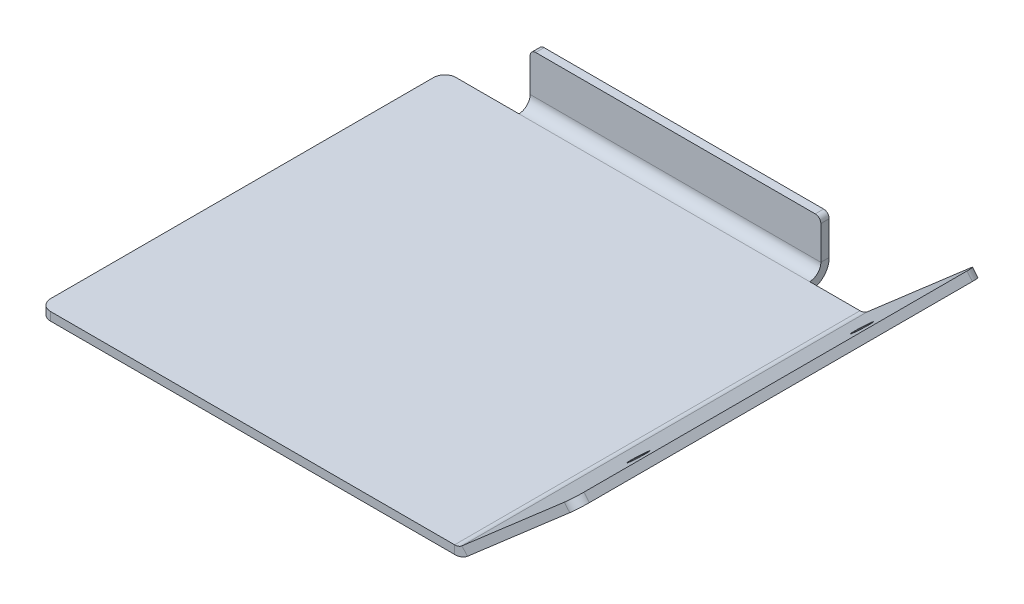
ISO-10303-21;
HEADER;
FILE_DESCRIPTION(('STEP AP214'),'2;1');
FILE_NAME('part.step','',(''),(''),'','','');
FILE_SCHEMA(('AUTOMOTIVE_DESIGN { 1 0 10303 214 1 1 1 1 }'));
ENDSEC;
DATA;
#1=APPLICATION_CONTEXT('core data for automotive mechanical design processes');
#2=APPLICATION_PROTOCOL_DEFINITION('international standard','automotive_design',2000,#1);
#3=PRODUCT_CONTEXT('',#1,'mechanical');
#4=PRODUCT('Part','Part','',(#3));
#5=PRODUCT_RELATED_PRODUCT_CATEGORY('part','',(#4));
#6=PRODUCT_DEFINITION_FORMATION('','',#4);
#7=PRODUCT_DEFINITION_CONTEXT('part definition',#1,'design');
#8=PRODUCT_DEFINITION('design','',#6,#7);
#9=PRODUCT_DEFINITION_SHAPE('','',#8);
#10=(LENGTH_UNIT() NAMED_UNIT(*) SI_UNIT(.MILLI.,.METRE.));
#11=(NAMED_UNIT(*) PLANE_ANGLE_UNIT() SI_UNIT($,.RADIAN.));
#12=(NAMED_UNIT(*) SI_UNIT($,.STERADIAN.) SOLID_ANGLE_UNIT());
#13=UNCERTAINTY_MEASURE_WITH_UNIT(LENGTH_MEASURE(1.E-05),#10,'distance_accuracy_value','');
#14=(GEOMETRIC_REPRESENTATION_CONTEXT(3) GLOBAL_UNCERTAINTY_ASSIGNED_CONTEXT((#13)) GLOBAL_UNIT_ASSIGNED_CONTEXT((#10,
#11,#12)) REPRESENTATION_CONTEXT('',''));
#15=CARTESIAN_POINT('',(0.,0.,0.));
#16=DIRECTION('',(0.,0.,1.));
#17=DIRECTION('',(1.,0.,0.));
#18=AXIS2_PLACEMENT_3D('',#15,#16,#17);
#19=CARTESIAN_POINT('',(0.,-1.5,72.5));
#20=DIRECTION('',(0.,1.,0.));
#21=DIRECTION('',(0.,0.,1.));
#22=AXIS2_PLACEMENT_3D('',#19,#20,#21);
#23=PLANE('',#22);
#24=DIRECTION('',(0.,0.,-1.));
#25=VECTOR('',#24,1.);
#26=CARTESIAN_POINT('',(0.,-1.5,72.5));
#27=LINE('',#26,#25);
#28=CARTESIAN_POINT('',(0.,-1.5,70.5));
#29=VERTEX_POINT('',#28);
#30=CARTESIAN_POINT('',(0.,-1.5,2.));
#31=VERTEX_POINT('',#30);
#32=EDGE_CURVE('E518',#29,#31,#27,.T.);
#33=ORIENTED_EDGE('',*,*,#32,.T.);
#34=CARTESIAN_POINT('',(2.,-1.5,2.));
#35=DIRECTION('',(0.,1.,0.));
#36=DIRECTION('',(0.,0.,1.));
#37=AXIS2_PLACEMENT_3D('',#34,#35,#36);
#38=CIRCLE('',#37,2.);
#39=CARTESIAN_POINT('',(2.,-1.5,0.));
#40=VERTEX_POINT('',#39);
#41=EDGE_CURVE('E478',#31,#40,#38,.F.);
#42=ORIENTED_EDGE('',*,*,#41,.T.);
#43=DIRECTION('',(1.,0.,0.));
#44=VECTOR('',#43,1.);
#45=CARTESIAN_POINT('',(0.,-1.5,0.));
#46=LINE('',#45,#44);
#47=CARTESIAN_POINT('',(13.2522306410304,-1.5,0.));
#48=VERTEX_POINT('',#47);
#49=EDGE_CURVE('E446',#40,#48,#46,.T.);
#50=ORIENTED_EDGE('',*,*,#49,.T.);
#51=DIRECTION('',(-1.,0.,0.));
#52=VECTOR('',#51,1.);
#53=CARTESIAN_POINT('',(13.2522306410304,-1.50000000000002,0.));
#54=LINE('',#53,#52);
#55=CARTESIAN_POINT('',(65.2522306410304,-1.50000000000003,0.));
#56=VERTEX_POINT('',#55);
#57=EDGE_CURVE('E215',#48,#56,#54,.F.);
#58=ORIENTED_EDGE('',*,*,#57,.T.);
#59=CARTESIAN_POINT('',(74.2522306410304,-1.5,0.));
#60=VERTEX_POINT('',#59);
#61=EDGE_CURVE('E444',#56,#60,#46,.T.);
#62=ORIENTED_EDGE('',*,*,#61,.T.);
#63=DIRECTION('',(0.,0.,-1.));
#64=VECTOR('',#63,1.);
#65=CARTESIAN_POINT('',(74.2522306410304,-1.5,72.5));
#66=LINE('',#65,#64);
#67=CARTESIAN_POINT('',(74.2522306410304,-1.5,72.5));
#68=VERTEX_POINT('',#67);
#69=EDGE_CURVE('E520',#68,#60,#66,.T.);
#70=ORIENTED_EDGE('',*,*,#69,.F.);
#71=DIRECTION('',(1.,0.,0.));
#72=VECTOR('',#71,1.);
#73=CARTESIAN_POINT('',(0.,-1.5,72.5));
#74=LINE('',#73,#72);
#75=CARTESIAN_POINT('',(2.,-1.5,72.5));
#76=VERTEX_POINT('',#75);
#77=EDGE_CURVE('E531',#76,#68,#74,.T.);
#78=ORIENTED_EDGE('',*,*,#77,.F.);
#79=CARTESIAN_POINT('',(2.,-1.5,70.5));
#80=DIRECTION('',(0.,1.,0.));
#81=DIRECTION('',(0.,0.,1.));
#82=AXIS2_PLACEMENT_3D('',#79,#80,#81);
#83=CIRCLE('',#82,2.);
#84=EDGE_CURVE('E480',#76,#29,#83,.F.);
#85=ORIENTED_EDGE('',*,*,#84,.T.);
#86=EDGE_LOOP('',(#33,#42,#50,#58,#62,#70,#78,#85));
#87=FACE_BOUND('',#86,.T.);
#88=DIRECTION('',(0.,0.,-1.));
#89=VECTOR('',#88,1.);
#90=CARTESIAN_POINT('',(8.1261153205152,-1.5,72.5));
#91=LINE('',#90,#89);
#92=CARTESIAN_POINT('',(8.1261153205152,-1.5,62.25));
#93=VERTEX_POINT('',#92);
#94=CARTESIAN_POINT('',(8.1261153205152,-1.5,10.25));
#95=VERTEX_POINT('',#94);
#96=EDGE_CURVE('E13',#93,#95,#91,.T.);
#97=ORIENTED_EDGE('',*,*,#96,.F.);
#98=DIRECTION('',(-1.,0.,0.));
#99=VECTOR('',#98,1.);
#100=CARTESIAN_POINT('',(0.,-1.5,62.25));
#101=LINE('',#100,#99);
#102=CARTESIAN_POINT('',(68.1261153205152,-1.5,62.25));
#103=VERTEX_POINT('',#102);
#104=EDGE_CURVE('E299',#103,#93,#101,.T.);
#105=ORIENTED_EDGE('',*,*,#104,.F.);
#106=DIRECTION('',(0.,0.,1.));
#107=VECTOR('',#106,1.);
#108=CARTESIAN_POINT('',(68.1261153205152,-1.5,72.5));
#109=LINE('',#108,#107);
#110=CARTESIAN_POINT('',(68.1261153205152,-1.5,10.25));
#111=VERTEX_POINT('',#110);
#112=EDGE_CURVE('E302',#111,#103,#109,.T.);
#113=ORIENTED_EDGE('',*,*,#112,.F.);
#114=DIRECTION('',(1.,0.,0.));
#115=VECTOR('',#114,1.);
#116=CARTESIAN_POINT('',(0.,-1.5,10.25));
#117=LINE('',#116,#115);
#118=EDGE_CURVE('E71',#95,#111,#117,.T.);
#119=ORIENTED_EDGE('',*,*,#118,.F.);
#120=EDGE_LOOP('',(#97,#105,#113,#119));
#121=FACE_BOUND('',#120,.T.);
#122=ADVANCED_FACE('F62',(#87,#121),#23,.F.);
#123=CARTESIAN_POINT('',(76.5484372424972,-0.641483530779695,0.));
#124=DIRECTION('',(0.,0.,-1.));
#125=DIRECTION('',(-1.,0.,0.));
#126=AXIS2_PLACEMENT_3D('',#123,#124,#125);
#127=PLANE('',#126);
#128=DIRECTION('',(1.,0.,0.));
#129=VECTOR('',#128,1.);
#130=CARTESIAN_POINT('',(0.,0.,0.));
#131=LINE('',#130,#129);
#132=CARTESIAN_POINT('',(2.,0.,0.));
#133=VERTEX_POINT('',#132);
#134=CARTESIAN_POINT('',(13.2522306410304,0.,0.));
#135=VERTEX_POINT('',#134);
#136=EDGE_CURVE('E431',#133,#135,#131,.T.);
#137=ORIENTED_EDGE('',*,*,#136,.T.);
#138=DIRECTION('',(0.,-1.,0.));
#139=VECTOR('',#138,1.);
#140=CARTESIAN_POINT('',(13.2522306410304,0.,0.));
#141=LINE('',#140,#139);
#142=EDGE_CURVE('E269',#135,#48,#141,.T.);
#143=ORIENTED_EDGE('',*,*,#142,.T.);
#144=ORIENTED_EDGE('',*,*,#49,.F.);
#145=DIRECTION('',(0.,1.,0.));
#146=VECTOR('',#145,1.);
#147=CARTESIAN_POINT('',(2.,-0.641483530779695,0.));
#148=LINE('',#147,#146);
#149=EDGE_CURVE('E491',#40,#133,#148,.T.);
#150=ORIENTED_EDGE('',*,*,#149,.T.);
#151=EDGE_LOOP('',(#137,#143,#144,#150));
#152=FACE_BOUND('',#151,.T.);
#153=ADVANCED_FACE('F317',(#152),#127,.T.);
#154=CARTESIAN_POINT('',(75.5643486990114,0.49058083955446,72.5));
#155=DIRECTION('',(0.,0.,1.));
#156=DIRECTION('',(1.,0.,0.));
#157=AXIS2_PLACEMENT_3D('',#154,#155,#156);
#158=PLANE('',#157);
#159=DIRECTION('',(0.656059028990509,-0.75470958022277,0.));
#160=VECTOR('',#159,1.);
#161=CARTESIAN_POINT('',(75.5643486990114,0.49058083955446,72.5));
#162=LINE('',#161,#160);
#163=CARTESIAN_POINT('',(75.5643486990114,0.49058083955446,72.5));
#164=VERTEX_POINT('',#163);
#165=CARTESIAN_POINT('',(76.5484372424972,-0.641483530779695,72.5));
#166=VERTEX_POINT('',#165);
#167=EDGE_CURVE('E494',#164,#166,#162,.T.);
#168=ORIENTED_EDGE('',*,*,#167,.F.);
#169=CARTESIAN_POINT('',(74.2522306410304,2.,72.5));
#170=DIRECTION('',(0.,0.,-1.));
#171=DIRECTION('',(-1.,0.,0.));
#172=AXIS2_PLACEMENT_3D('',#169,#170,#171);
#173=CIRCLE('',#172,2.);
#174=CARTESIAN_POINT('',(74.2522306410304,0.,72.5));
#175=VERTEX_POINT('',#174);
#176=EDGE_CURVE('E553',#175,#164,#173,.F.);
#177=ORIENTED_EDGE('',*,*,#176,.F.);
#178=DIRECTION('',(0.,1.,0.));
#179=VECTOR('',#178,1.);
#180=CARTESIAN_POINT('',(74.2522306410304,-1.5,72.5));
#181=LINE('',#180,#179);
#182=EDGE_CURVE('E496',#68,#175,#181,.T.);
#183=ORIENTED_EDGE('',*,*,#182,.F.);
#184=CARTESIAN_POINT('',(74.2522306410304,2.,72.5));
#185=DIRECTION('',(0.,0.,1.));
#186=DIRECTION('',(1.,0.,0.));
#187=AXIS2_PLACEMENT_3D('',#184,#185,#186);
#188=CIRCLE('',#187,3.5);
#189=EDGE_CURVE('E524',#68,#166,#188,.T.);
#190=ORIENTED_EDGE('',*,*,#189,.T.);
#191=EDGE_LOOP('',(#168,#177,#183,#190));
#192=FACE_BOUND('',#191,.T.);
#193=ADVANCED_FACE('F323',(#192),#158,.T.);
#194=CARTESIAN_POINT('',(74.2522306410304,-1.5,72.5));
#195=DIRECTION('',(0.,0.,1.));
#196=DIRECTION('',(1.,0.,0.));
#197=AXIS2_PLACEMENT_3D('',#194,#195,#196);
#198=PLANE('',#197);
#199=DIRECTION('',(0.754709580222771,0.656059028990508,0.));
#200=VECTOR('',#199,1.);
#201=CARTESIAN_POINT('',(75.9840885434858,-1.13206437033416,72.5));
#202=LINE('',#201,#200);
#203=CARTESIAN_POINT('',(94.851828049055,15.2694113544285,72.5));
#204=VERTEX_POINT('',#203);
#205=EDGE_CURVE('E565',#166,#204,#202,.T.);
#206=ORIENTED_EDGE('',*,*,#205,.T.);
#207=DIRECTION('',(0.656059028990509,-0.754709580222771,0.));
#208=VECTOR('',#207,1.);
#209=CARTESIAN_POINT('',(94.288590567886,15.9173419585281,72.5));
#210=LINE('',#209,#208);
#211=CARTESIAN_POINT('',(93.8677395055693,16.4014757247627,72.5));
#212=VERTEX_POINT('',#211);
#213=EDGE_CURVE('E465',#204,#212,#210,.F.);
#214=ORIENTED_EDGE('',*,*,#213,.T.);
#215=DIRECTION('',(0.754709580222771,0.656059028990509,0.));
#216=VECTOR('',#215,1.);
#217=CARTESIAN_POINT('',(75.,0.,72.5));
#218=LINE('',#217,#216);
#219=EDGE_CURVE('E566',#164,#212,#218,.T.);
#220=ORIENTED_EDGE('',*,*,#219,.F.);
#221=ORIENTED_EDGE('',*,*,#167,.T.);
#222=EDGE_LOOP('',(#206,#214,#220,#221));
#223=FACE_BOUND('',#222,.T.);
#224=ADVANCED_FACE('F369',(#223),#198,.T.);
#225=CARTESIAN_POINT('',(74.2522306410304,0.,0.));
#226=DIRECTION('',(0.,0.,-1.));
#227=DIRECTION('',(-1.,0.,0.));
#228=AXIS2_PLACEMENT_3D('',#225,#226,#227);
#229=PLANE('',#228);
#230=DIRECTION('',(0.,-1.,0.));
#231=VECTOR('',#230,1.);
#232=CARTESIAN_POINT('',(74.2522306410304,0.,0.));
#233=LINE('',#232,#231);
#234=CARTESIAN_POINT('',(74.2522306410304,0.,0.));
#235=VERTEX_POINT('',#234);
#236=EDGE_CURVE('E499',#235,#60,#233,.T.);
#237=ORIENTED_EDGE('',*,*,#236,.F.);
#238=CARTESIAN_POINT('',(74.2522306410304,2.,0.));
#239=DIRECTION('',(0.,0.,-1.));
#240=DIRECTION('',(-1.,0.,0.));
#241=AXIS2_PLACEMENT_3D('',#238,#239,#240);
#242=CIRCLE('',#241,2.);
#243=CARTESIAN_POINT('',(75.5643486990114,0.49058083955446,0.));
#244=VERTEX_POINT('',#243);
#245=EDGE_CURVE('E432',#235,#244,#242,.F.);
#246=ORIENTED_EDGE('',*,*,#245,.T.);
#247=DIRECTION('',(-0.656059028990509,0.75470958022277,0.));
#248=VECTOR('',#247,1.);
#249=CARTESIAN_POINT('',(76.5484372424972,-0.641483530779695,0.));
#250=LINE('',#249,#248);
#251=CARTESIAN_POINT('',(76.5484372424972,-0.641483530779695,0.));
#252=VERTEX_POINT('',#251);
#253=EDGE_CURVE('E502',#252,#244,#250,.T.);
#254=ORIENTED_EDGE('',*,*,#253,.F.);
#255=CARTESIAN_POINT('',(74.2522306410304,2.,0.));
#256=DIRECTION('',(0.,0.,1.));
#257=DIRECTION('',(1.,0.,0.));
#258=AXIS2_PLACEMENT_3D('',#255,#256,#257);
#259=CIRCLE('',#258,3.5);
#260=EDGE_CURVE('E441',#60,#252,#259,.T.);
#261=ORIENTED_EDGE('',*,*,#260,.F.);
#262=EDGE_LOOP('',(#237,#246,#254,#261));
#263=FACE_BOUND('',#262,.T.);
#264=ADVANCED_FACE('F365',(#263),#229,.T.);
#265=DIRECTION('',(0.,-1.,0.));
#266=VECTOR('',#265,1.);
#267=CARTESIAN_POINT('',(65.2522306410304,0.,0.));
#268=LINE('',#267,#266);
#269=CARTESIAN_POINT('',(65.2522306410304,0.,0.));
#270=VERTEX_POINT('',#269);
#271=EDGE_CURVE('E265',#270,#56,#268,.T.);
#272=ORIENTED_EDGE('',*,*,#271,.F.);
#273=EDGE_CURVE('E428',#270,#235,#131,.T.);
#274=ORIENTED_EDGE('',*,*,#273,.T.);
#275=ORIENTED_EDGE('',*,*,#236,.T.);
#276=ORIENTED_EDGE('',*,*,#61,.F.);
#277=EDGE_LOOP('',(#272,#274,#275,#276));
#278=FACE_BOUND('',#277,.T.);
#279=ADVANCED_FACE('F326',(#278),#127,.T.);
#280=CARTESIAN_POINT('',(75.9840885434858,-1.13206437033416,72.5));
#281=DIRECTION('',(-0.656059028990508,0.754709580222771,0.));
#282=DIRECTION('',(-0.754709580222771,-0.656059028990508,0.));
#283=AXIS2_PLACEMENT_3D('',#280,#281,#282);
#284=PLANE('',#283);
#285=CARTESIAN_POINT('',(91.832989728164,12.6451752384665,56.25));
#286=DIRECTION('',(0.656059028990508,-0.754709580222771,0.));
#287=DIRECTION('',(0.754709580222771,0.656059028990508,0.));
#288=AXIS2_PLACEMENT_3D('',#285,#286,#287);
#289=CIRCLE('',#288,3.15);
#290=CARTESIAN_POINT('',(94.2103249058657,14.7117611797866,56.25));
#291=VERTEX_POINT('',#290);
#292=EDGE_CURVE('E268',#291,#291,#289,.T.);
#293=ORIENTED_EDGE('',*,*,#292,.F.);
#294=EDGE_LOOP('',(#293));
#295=FACE_BOUND('',#294,.T.);
#296=CARTESIAN_POINT('',(91.832989728164,12.6451752384665,16.25));
#297=DIRECTION('',(0.656059028990508,-0.754709580222771,0.));
#298=DIRECTION('',(0.754709580222771,0.656059028990508,0.));
#299=AXIS2_PLACEMENT_3D('',#296,#297,#298);
#300=CIRCLE('',#299,3.15);
#301=CARTESIAN_POINT('',(94.2103249058657,14.7117611797866,16.25));
#302=VERTEX_POINT('',#301);
#303=EDGE_CURVE('E452',#302,#302,#300,.T.);
#304=ORIENTED_EDGE('',*,*,#303,.F.);
#305=EDGE_LOOP('',(#304));
#306=FACE_BOUND('',#305,.T.);
#307=DIRECTION('',(0.,0.,-1.));
#308=VECTOR('',#307,1.);
#309=CARTESIAN_POINT('',(96.3612472095006,16.5815294124096,72.5));
#310=LINE('',#309,#308);
#311=CARTESIAN_POINT('',(96.3612472095006,16.5815294124096,70.5));
#312=VERTEX_POINT('',#311);
#313=CARTESIAN_POINT('',(96.3612472095006,16.5815294124096,2.));
#314=VERTEX_POINT('',#313);
#315=EDGE_CURVE('E504',#312,#314,#310,.T.);
#316=ORIENTED_EDGE('',*,*,#315,.F.);
#317=CARTESIAN_POINT('',(94.851828049055,15.2694113544285,70.5));
#318=DIRECTION('',(-0.656059028990508,0.754709580222771,0.));
#319=DIRECTION('',(-0.754709580222771,-0.656059028990508,0.));
#320=AXIS2_PLACEMENT_3D('',#317,#318,#319);
#321=CIRCLE('',#320,2.);
#322=EDGE_CURVE('E467',#312,#204,#321,.F.);
#323=ORIENTED_EDGE('',*,*,#322,.T.);
#324=ORIENTED_EDGE('',*,*,#205,.F.);
#325=DIRECTION('',(0.,0.,-1.));
#326=VECTOR('',#325,1.);
#327=CARTESIAN_POINT('',(76.5484372424972,-0.641483530779695,72.5));
#328=LINE('',#327,#326);
#329=EDGE_CURVE('E522',#166,#252,#328,.T.);
#330=ORIENTED_EDGE('',*,*,#329,.T.);
#331=DIRECTION('',(0.754709580222771,0.656059028990508,0.));
#332=VECTOR('',#331,1.);
#333=CARTESIAN_POINT('',(75.9840885434858,-1.13206437033416,0.));
#334=LINE('',#333,#332);
#335=CARTESIAN_POINT('',(94.851828049055,15.2694113544285,0.));
#336=VERTEX_POINT('',#335);
#337=EDGE_CURVE('E457',#252,#336,#334,.T.);
#338=ORIENTED_EDGE('',*,*,#337,.T.);
#339=CARTESIAN_POINT('',(94.851828049055,15.2694113544285,2.));
#340=DIRECTION('',(-0.656059028990508,0.754709580222771,0.));
#341=DIRECTION('',(-0.754709580222771,-0.656059028990508,0.));
#342=AXIS2_PLACEMENT_3D('',#339,#340,#341);
#343=CIRCLE('',#342,2.);
#344=EDGE_CURVE('E469',#336,#314,#343,.F.);
#345=ORIENTED_EDGE('',*,*,#344,.T.);
#346=EDGE_LOOP('',(#316,#323,#324,#330,#338,#345));
#347=FACE_BOUND('',#346,.T.);
#348=ADVANCED_FACE('F359',(#295,#306,#347),#284,.F.);
#349=CARTESIAN_POINT('',(95.3771586660148,17.7135937827437,72.5));
#350=DIRECTION('',(0.754709580222771,0.656059028990509,0.));
#351=DIRECTION('',(-0.656059028990509,0.754709580222771,0.));
#352=AXIS2_PLACEMENT_3D('',#349,#350,#351);
#353=PLANE('',#352);
#354=DIRECTION('',(0.,0.,-1.));
#355=VECTOR('',#354,1.);
#356=CARTESIAN_POINT('',(95.3771586660148,17.7135937827437,72.5));
#357=LINE('',#356,#355);
#358=CARTESIAN_POINT('',(95.3771586660148,17.7135937827437,70.5));
#359=VERTEX_POINT('',#358);
#360=CARTESIAN_POINT('',(95.3771586660148,17.7135937827437,2.));
#361=VERTEX_POINT('',#360);
#362=EDGE_CURVE('E507',#359,#361,#357,.T.);
#363=ORIENTED_EDGE('',*,*,#362,.F.);
#364=DIRECTION('',(0.656059028990509,-0.754709580222771,0.));
#365=VECTOR('',#364,1.);
#366=CARTESIAN_POINT('',(95.3771586660148,17.7135937827437,70.5));
#367=LINE('',#366,#365);
#368=EDGE_CURVE('E471',#359,#312,#367,.T.);
#369=ORIENTED_EDGE('',*,*,#368,.T.);
#370=ORIENTED_EDGE('',*,*,#315,.T.);
#371=DIRECTION('',(0.656059028990509,-0.754709580222771,0.));
#372=VECTOR('',#371,1.);
#373=CARTESIAN_POINT('',(95.3771586660148,17.7135937827437,2.));
#374=LINE('',#373,#372);
#375=EDGE_CURVE('E474',#314,#361,#374,.F.);
#376=ORIENTED_EDGE('',*,*,#375,.T.);
#377=EDGE_LOOP('',(#363,#369,#370,#376));
#378=FACE_BOUND('',#377,.T.);
#379=ADVANCED_FACE('F355',(#378),#353,.T.);
#380=CARTESIAN_POINT('',(75.,0.,72.5));
#381=DIRECTION('',(-0.656059028990509,0.754709580222771,0.));
#382=DIRECTION('',(-0.754709580222771,-0.656059028990509,0.));
#383=AXIS2_PLACEMENT_3D('',#380,#381,#382);
#384=PLANE('',#383);
#385=CARTESIAN_POINT('',(90.8489011846782,13.7772396088007,56.25));
#386=DIRECTION('',(-0.656059028990509,0.754709580222771,0.));
#387=DIRECTION('',(-0.754709580222771,-0.656059028990509,0.));
#388=AXIS2_PLACEMENT_3D('',#385,#386,#387);
#389=CIRCLE('',#388,1.69999999999999);
#390=CARTESIAN_POINT('',(89.5658948982995,12.6619392595168,56.25));
#391=VERTEX_POINT('',#390);
#392=EDGE_CURVE('E449',#391,#391,#389,.T.);
#393=ORIENTED_EDGE('',*,*,#392,.F.);
#394=EDGE_LOOP('',(#393));
#395=FACE_BOUND('',#394,.T.);
#396=CARTESIAN_POINT('',(90.8489011846782,13.7772396088007,16.25));
#397=DIRECTION('',(-0.656059028990509,0.754709580222771,0.));
#398=DIRECTION('',(-0.754709580222771,-0.656059028990509,0.));
#399=AXIS2_PLACEMENT_3D('',#396,#397,#398);
#400=CIRCLE('',#399,1.69999999999999);
#401=CARTESIAN_POINT('',(89.5658948982995,12.6619392595168,16.25));
#402=VERTEX_POINT('',#401);
#403=EDGE_CURVE('E454',#402,#402,#400,.T.);
#404=ORIENTED_EDGE('',*,*,#403,.F.);
#405=EDGE_LOOP('',(#404));
#406=FACE_BOUND('',#405,.T.);
#407=ORIENTED_EDGE('',*,*,#219,.T.);
#408=CARTESIAN_POINT('',(93.8677395055693,16.4014757247627,70.5));
#409=DIRECTION('',(-0.656059028990509,0.754709580222771,0.));
#410=DIRECTION('',(-0.754709580222771,-0.656059028990509,0.));
#411=AXIS2_PLACEMENT_3D('',#408,#409,#410);
#412=CIRCLE('',#411,2.);
#413=EDGE_CURVE('E461',#212,#359,#412,.T.);
#414=ORIENTED_EDGE('',*,*,#413,.T.);
#415=ORIENTED_EDGE('',*,*,#362,.T.);
#416=CARTESIAN_POINT('',(93.8677395055693,16.4014757247627,2.));
#417=DIRECTION('',(-0.656059028990509,0.754709580222771,0.));
#418=DIRECTION('',(-0.754709580222771,-0.656059028990509,0.));
#419=AXIS2_PLACEMENT_3D('',#416,#417,#418);
#420=CIRCLE('',#419,2.);
#421=CARTESIAN_POINT('',(93.8677395055693,16.4014757247627,0.));
#422=VERTEX_POINT('',#421);
#423=EDGE_CURVE('E463',#361,#422,#420,.T.);
#424=ORIENTED_EDGE('',*,*,#423,.T.);
#425=DIRECTION('',(0.754709580222771,0.656059028990509,0.));
#426=VECTOR('',#425,1.);
#427=CARTESIAN_POINT('',(75.,0.,0.));
#428=LINE('',#427,#426);
#429=EDGE_CURVE('E539',#244,#422,#428,.T.);
#430=ORIENTED_EDGE('',*,*,#429,.F.);
#431=DIRECTION('',(0.,0.,-1.));
#432=VECTOR('',#431,1.);
#433=CARTESIAN_POINT('',(75.5643486990114,0.49058083955446,72.5));
#434=LINE('',#433,#432);
#435=EDGE_CURVE('E510',#164,#244,#434,.T.);
#436=ORIENTED_EDGE('',*,*,#435,.F.);
#437=EDGE_LOOP('',(#407,#414,#415,#424,#430,#436));
#438=FACE_BOUND('',#437,.T.);
#439=ADVANCED_FACE('F351',(#395,#406,#438),#384,.T.);
#440=CARTESIAN_POINT('',(74.2522306410304,2.,72.5));
#441=DIRECTION('',(0.,0.,-1.));
#442=DIRECTION('',(-1.,0.,0.));
#443=AXIS2_PLACEMENT_3D('',#440,#441,#442);
#444=CYLINDRICAL_SURFACE('',#443,2.);
#445=ORIENTED_EDGE('',*,*,#245,.F.);
#446=DIRECTION('',(0.,0.,-1.));
#447=VECTOR('',#446,1.);
#448=CARTESIAN_POINT('',(74.2522306410304,0.,72.5));
#449=LINE('',#448,#447);
#450=EDGE_CURVE('E513',#175,#235,#449,.T.);
#451=ORIENTED_EDGE('',*,*,#450,.F.);
#452=ORIENTED_EDGE('',*,*,#176,.T.);
#453=ORIENTED_EDGE('',*,*,#435,.T.);
#454=EDGE_LOOP('',(#445,#451,#452,#453));
#455=FACE_BOUND('',#454,.T.);
#456=ADVANCED_FACE('F344',(#455),#444,.F.);
#457=CARTESIAN_POINT('',(0.,0.,72.5));
#458=DIRECTION('',(0.,1.,0.));
#459=DIRECTION('',(0.,0.,1.));
#460=AXIS2_PLACEMENT_3D('',#457,#458,#459);
#461=PLANE('',#460);
#462=ORIENTED_EDGE('',*,*,#136,.F.);
#463=CARTESIAN_POINT('',(2.,0.,2.));
#464=DIRECTION('',(0.,1.,0.));
#465=DIRECTION('',(0.,0.,1.));
#466=AXIS2_PLACEMENT_3D('',#463,#464,#465);
#467=CIRCLE('',#466,2.);
#468=CARTESIAN_POINT('',(0.,0.,2.));
#469=VERTEX_POINT('',#468);
#470=EDGE_CURVE('E487',#133,#469,#467,.T.);
#471=ORIENTED_EDGE('',*,*,#470,.T.);
#472=DIRECTION('',(0.,0.,-1.));
#473=VECTOR('',#472,1.);
#474=CARTESIAN_POINT('',(0.,0.,72.5));
#475=LINE('',#474,#473);
#476=CARTESIAN_POINT('',(0.,0.,70.5));
#477=VERTEX_POINT('',#476);
#478=EDGE_CURVE('E516',#477,#469,#475,.T.);
#479=ORIENTED_EDGE('',*,*,#478,.F.);
#480=CARTESIAN_POINT('',(2.,0.,70.5));
#481=DIRECTION('',(0.,1.,0.));
#482=DIRECTION('',(0.,0.,1.));
#483=AXIS2_PLACEMENT_3D('',#480,#481,#482);
#484=CIRCLE('',#483,2.);
#485=CARTESIAN_POINT('',(2.,0.,72.5));
#486=VERTEX_POINT('',#485);
#487=EDGE_CURVE('E489',#477,#486,#484,.T.);
#488=ORIENTED_EDGE('',*,*,#487,.T.);
#489=DIRECTION('',(1.,0.,0.));
#490=VECTOR('',#489,1.);
#491=CARTESIAN_POINT('',(0.,0.,72.5));
#492=LINE('',#491,#490);
#493=EDGE_CURVE('E535',#486,#175,#492,.T.);
#494=ORIENTED_EDGE('',*,*,#493,.T.);
#495=ORIENTED_EDGE('',*,*,#450,.T.);
#496=ORIENTED_EDGE('',*,*,#273,.F.);
#497=DIRECTION('',(-1.,0.,0.));
#498=VECTOR('',#497,1.);
#499=CARTESIAN_POINT('',(13.2522306410304,0.,0.));
#500=LINE('',#499,#498);
#501=EDGE_CURVE('E274',#135,#270,#500,.F.);
#502=ORIENTED_EDGE('',*,*,#501,.F.);
#503=EDGE_LOOP('',(#462,#471,#479,#488,#494,#495,#496,#502));
#504=FACE_BOUND('',#503,.T.);
#505=ADVANCED_FACE('F339',(#504),#461,.T.);
#506=CARTESIAN_POINT('',(0.,-1.5,72.5));
#507=DIRECTION('',(-1.,0.,0.));
#508=DIRECTION('',(0.,0.,1.));
#509=AXIS2_PLACEMENT_3D('',#506,#507,#508);
#510=PLANE('',#509);
#511=ORIENTED_EDGE('',*,*,#478,.T.);
#512=DIRECTION('',(0.,1.,0.));
#513=VECTOR('',#512,1.);
#514=CARTESIAN_POINT('',(0.,-1.5,2.));
#515=LINE('',#514,#513);
#516=EDGE_CURVE('E482',#469,#31,#515,.F.);
#517=ORIENTED_EDGE('',*,*,#516,.T.);
#518=ORIENTED_EDGE('',*,*,#32,.F.);
#519=DIRECTION('',(0.,1.,0.));
#520=VECTOR('',#519,1.);
#521=CARTESIAN_POINT('',(0.,0.,70.5));
#522=LINE('',#521,#520);
#523=EDGE_CURVE('E484',#29,#477,#522,.T.);
#524=ORIENTED_EDGE('',*,*,#523,.T.);
#525=EDGE_LOOP('',(#511,#517,#518,#524));
#526=FACE_BOUND('',#525,.T.);
#527=ADVANCED_FACE('F332',(#526),#510,.T.);
#528=ORIENTED_EDGE('',*,*,#104,.T.);
#529=ORIENTED_EDGE('',*,*,#96,.T.);
#530=ORIENTED_EDGE('',*,*,#118,.T.);
#531=ORIENTED_EDGE('',*,*,#112,.T.);
#532=EDGE_LOOP('',(#528,#529,#530,#531));
#533=FACE_BOUND('',#532,.T.);
#534=ADVANCED_FACE('F314',(#533),#23,.F.);
#535=CARTESIAN_POINT('',(74.2522306410304,2.,72.5));
#536=DIRECTION('',(0.,0.,-1.));
#537=DIRECTION('',(-1.,0.,0.));
#538=AXIS2_PLACEMENT_3D('',#535,#536,#537);
#539=CYLINDRICAL_SURFACE('',#538,3.5);
#540=ORIENTED_EDGE('',*,*,#260,.T.);
#541=ORIENTED_EDGE('',*,*,#329,.F.);
#542=ORIENTED_EDGE('',*,*,#189,.F.);
#543=ORIENTED_EDGE('',*,*,#69,.T.);
#544=EDGE_LOOP('',(#540,#541,#542,#543));
#545=FACE_BOUND('',#544,.T.);
#546=ADVANCED_FACE('F331',(#545),#539,.T.);
#547=CARTESIAN_POINT('',(74.2522306410304,2.,72.5));
#548=DIRECTION('',(0.,0.,-1.));
#549=DIRECTION('',(-1.,0.,0.));
#550=AXIS2_PLACEMENT_3D('',#547,#548,#549);
#551=PLANE('',#550);
#552=ORIENTED_EDGE('',*,*,#493,.F.);
#553=DIRECTION('',(0.,1.,0.));
#554=VECTOR('',#553,1.);
#555=CARTESIAN_POINT('',(2.,-1.5,72.5));
#556=LINE('',#555,#554);
#557=EDGE_CURVE('E476',#486,#76,#556,.F.);
#558=ORIENTED_EDGE('',*,*,#557,.T.);
#559=ORIENTED_EDGE('',*,*,#77,.T.);
#560=ORIENTED_EDGE('',*,*,#182,.T.);
#561=EDGE_LOOP('',(#552,#558,#559,#560));
#562=FACE_BOUND('',#561,.T.);
#563=ADVANCED_FACE('F337',(#562),#551,.F.);
#564=CARTESIAN_POINT('',(74.2522306410304,2.,0.));
#565=DIRECTION('',(0.,0.,-1.));
#566=DIRECTION('',(-1.,0.,0.));
#567=AXIS2_PLACEMENT_3D('',#564,#565,#566);
#568=PLANE('',#567);
#569=ORIENTED_EDGE('',*,*,#429,.T.);
#570=DIRECTION('',(0.656059028990509,-0.754709580222771,0.));
#571=VECTOR('',#570,1.);
#572=CARTESIAN_POINT('',(92.5556214475882,17.9108948852083,0.));
#573=LINE('',#572,#571);
#574=EDGE_CURVE('E284',#422,#336,#573,.T.);
#575=ORIENTED_EDGE('',*,*,#574,.T.);
#576=ORIENTED_EDGE('',*,*,#337,.F.);
#577=ORIENTED_EDGE('',*,*,#253,.T.);
#578=EDGE_LOOP('',(#569,#575,#576,#577));
#579=FACE_BOUND('',#578,.T.);
#580=ADVANCED_FACE('F381',(#579),#568,.T.);
#581=CARTESIAN_POINT('',(2.,-0.641483530779695,2.));
#582=DIRECTION('',(0.,1.,0.));
#583=DIRECTION('',(0.,0.,1.));
#584=AXIS2_PLACEMENT_3D('',#581,#582,#583);
#585=CYLINDRICAL_SURFACE('',#584,2.);
#586=ORIENTED_EDGE('',*,*,#41,.F.);
#587=ORIENTED_EDGE('',*,*,#516,.F.);
#588=ORIENTED_EDGE('',*,*,#470,.F.);
#589=ORIENTED_EDGE('',*,*,#149,.F.);
#590=EDGE_LOOP('',(#586,#587,#588,#589));
#591=FACE_BOUND('',#590,.T.);
#592=ADVANCED_FACE('F377',(#591),#585,.T.);
#593=CARTESIAN_POINT('',(2.,-1.5,70.5));
#594=DIRECTION('',(0.,-1.,0.));
#595=DIRECTION('',(0.,0.,-1.));
#596=AXIS2_PLACEMENT_3D('',#593,#594,#595);
#597=CYLINDRICAL_SURFACE('',#596,2.);
#598=ORIENTED_EDGE('',*,*,#84,.F.);
#599=ORIENTED_EDGE('',*,*,#557,.F.);
#600=ORIENTED_EDGE('',*,*,#487,.F.);
#601=ORIENTED_EDGE('',*,*,#523,.F.);
#602=EDGE_LOOP('',(#598,#599,#600,#601));
#603=FACE_BOUND('',#602,.T.);
#604=ADVANCED_FACE('F380',(#603),#597,.T.);
#605=CARTESIAN_POINT('',(93.8677395055693,16.4014757247627,70.5));
#606=DIRECTION('',(0.656059028990509,-0.754709580222771,0.));
#607=DIRECTION('',(0.754709580222771,0.656059028990509,0.));
#608=AXIS2_PLACEMENT_3D('',#605,#606,#607);
#609=CYLINDRICAL_SURFACE('',#608,2.);
#610=ORIENTED_EDGE('',*,*,#413,.F.);
#611=ORIENTED_EDGE('',*,*,#213,.F.);
#612=ORIENTED_EDGE('',*,*,#322,.F.);
#613=ORIENTED_EDGE('',*,*,#368,.F.);
#614=EDGE_LOOP('',(#610,#611,#612,#613));
#615=FACE_BOUND('',#614,.T.);
#616=ADVANCED_FACE('F385',(#615),#609,.T.);
#617=CARTESIAN_POINT('',(92.5556214475882,17.9108948852083,2.));
#618=DIRECTION('',(0.656059028990509,-0.754709580222771,0.));
#619=DIRECTION('',(0.754709580222771,0.656059028990509,0.));
#620=AXIS2_PLACEMENT_3D('',#617,#618,#619);
#621=CYLINDRICAL_SURFACE('',#620,2.);
#622=ORIENTED_EDGE('',*,*,#423,.F.);
#623=ORIENTED_EDGE('',*,*,#375,.F.);
#624=ORIENTED_EDGE('',*,*,#344,.F.);
#625=ORIENTED_EDGE('',*,*,#574,.F.);
#626=EDGE_LOOP('',(#622,#623,#624,#625));
#627=FACE_BOUND('',#626,.T.);
#628=ADVANCED_FACE('F389',(#627),#621,.T.);
#629=CARTESIAN_POINT('',(91.832989728164,12.6451752384665,16.25));
#630=DIRECTION('',(0.656059028990508,-0.754709580222771,0.));
#631=DIRECTION('',(0.754709580222771,0.656059028990508,0.));
#632=AXIS2_PLACEMENT_3D('',#629,#630,#631);
#633=CYLINDRICAL_SURFACE('',#632,1.69999999999999);
#634=ORIENTED_EDGE('',*,*,#403,.T.);
#635=EDGE_LOOP('',(#634));
#636=FACE_BOUND('',#635,.T.);
#637=CARTESIAN_POINT('',(90.8817041361277,13.7395041297895,16.25));
#638=DIRECTION('',(0.656059028990508,-0.754709580222771,0.));
#639=DIRECTION('',(0.754709580222771,0.656059028990508,0.));
#640=AXIS2_PLACEMENT_3D('',#637,#638,#639);
#641=CIRCLE('',#640,1.7);
#642=CARTESIAN_POINT('',(92.1647104225064,14.8548044790734,16.25));
#643=VERTEX_POINT('',#642);
#644=EDGE_CURVE('E458',#643,#643,#641,.T.);
#645=ORIENTED_EDGE('',*,*,#644,.T.);
#646=EDGE_LOOP('',(#645));
#647=FACE_BOUND('',#646,.T.);
#648=ADVANCED_FACE('F392',(#636,#647),#633,.F.);
#649=CARTESIAN_POINT('',(91.832989728164,12.6451752384665,16.25));
#650=DIRECTION('',(0.656059028990508,-0.754709580222771,0.));
#651=DIRECTION('',(0.754709580222771,0.656059028990508,0.));
#652=AXIS2_PLACEMENT_3D('',#649,#650,#651);
#653=CONICAL_SURFACE('',#652,3.15,0.785398163397448);
#654=ORIENTED_EDGE('',*,*,#644,.F.);
#655=EDGE_LOOP('',(#654));
#656=FACE_BOUND('',#655,.T.);
#657=ORIENTED_EDGE('',*,*,#303,.T.);
#658=EDGE_LOOP('',(#657));
#659=FACE_BOUND('',#658,.T.);
#660=ADVANCED_FACE('F611',(#656,#659),#653,.F.);
#661=CARTESIAN_POINT('',(91.832989728164,12.6451752384665,56.25));
#662=DIRECTION('',(0.656059028990508,-0.754709580222771,0.));
#663=DIRECTION('',(0.754709580222771,0.656059028990508,0.));
#664=AXIS2_PLACEMENT_3D('',#661,#662,#663);
#665=CYLINDRICAL_SURFACE('',#664,1.69999999999999);
#666=ORIENTED_EDGE('',*,*,#392,.T.);
#667=EDGE_LOOP('',(#666));
#668=FACE_BOUND('',#667,.T.);
#669=CARTESIAN_POINT('',(90.8817041361277,13.7395041297895,56.25));
#670=DIRECTION('',(0.656059028990508,-0.754709580222771,0.));
#671=DIRECTION('',(0.754709580222771,0.656059028990508,0.));
#672=AXIS2_PLACEMENT_3D('',#669,#670,#671);
#673=CIRCLE('',#672,1.7);
#674=CARTESIAN_POINT('',(92.1647104225064,14.8548044790734,56.25));
#675=VERTEX_POINT('',#674);
#676=EDGE_CURVE('E453',#675,#675,#673,.T.);
#677=ORIENTED_EDGE('',*,*,#676,.T.);
#678=EDGE_LOOP('',(#677));
#679=FACE_BOUND('',#678,.T.);
#680=ADVANCED_FACE('F603',(#668,#679),#665,.F.);
#681=CARTESIAN_POINT('',(91.832989728164,12.6451752384665,56.25));
#682=DIRECTION('',(0.656059028990508,-0.754709580222771,0.));
#683=DIRECTION('',(0.754709580222771,0.656059028990508,0.));
#684=AXIS2_PLACEMENT_3D('',#681,#682,#683);
#685=CONICAL_SURFACE('',#684,3.15,0.785398163397448);
#686=ORIENTED_EDGE('',*,*,#676,.F.);
#687=EDGE_LOOP('',(#686));
#688=FACE_BOUND('',#687,.T.);
#689=ORIENTED_EDGE('',*,*,#292,.T.);
#690=EDGE_LOOP('',(#689));
#691=FACE_BOUND('',#690,.T.);
#692=ADVANCED_FACE('F596',(#688,#691),#685,.F.);
#693=CARTESIAN_POINT('',(65.2522306410304,1.99999999999997,0.));
#694=DIRECTION('',(1.,0.,0.));
#695=DIRECTION('',(0.,1.,0.));
#696=AXIS2_PLACEMENT_3D('',#693,#694,#695);
#697=PLANE('',#696);
#698=DIRECTION('',(0.,0.,1.));
#699=VECTOR('',#698,1.);
#700=CARTESIAN_POINT('',(65.2522306410304,1.99999999999999,-3.49999999999998));
#701=LINE('',#700,#699);
#702=CARTESIAN_POINT('',(65.2522306410304,1.99999999999996,-2.));
#703=VERTEX_POINT('',#702);
#704=CARTESIAN_POINT('',(65.2522306410304,1.99999999999995,-3.5));
#705=VERTEX_POINT('',#704);
#706=EDGE_CURVE('E257',#703,#705,#701,.F.);
#707=ORIENTED_EDGE('',*,*,#706,.F.);
#708=CARTESIAN_POINT('',(65.2522306410304,1.99999999999997,0.));
#709=DIRECTION('',(-1.,0.,0.));
#710=DIRECTION('',(0.,-1.,0.));
#711=AXIS2_PLACEMENT_3D('',#708,#709,#710);
#712=CIRCLE('',#711,2.);
#713=EDGE_CURVE('E218',#270,#703,#712,.F.);
#714=ORIENTED_EDGE('',*,*,#713,.F.);
#715=ORIENTED_EDGE('',*,*,#271,.T.);
#716=CARTESIAN_POINT('',(65.2522306410304,1.99999999999997,0.));
#717=DIRECTION('',(-1.,0.,0.));
#718=DIRECTION('',(0.,-1.,0.));
#719=AXIS2_PLACEMENT_3D('',#716,#717,#718);
#720=CIRCLE('',#719,3.5);
#721=EDGE_CURVE('E277',#56,#705,#720,.F.);
#722=ORIENTED_EDGE('',*,*,#721,.T.);
#723=EDGE_LOOP('',(#707,#714,#715,#722));
#724=FACE_BOUND('',#723,.T.);
#725=ADVANCED_FACE('F594',(#724),#697,.T.);
#726=CARTESIAN_POINT('',(13.2522306410304,1.99999999999998,0.));
#727=DIRECTION('',(1.,0.,0.));
#728=DIRECTION('',(0.,1.,0.));
#729=AXIS2_PLACEMENT_3D('',#726,#727,#728);
#730=PLANE('',#729);
#731=CARTESIAN_POINT('',(13.2522306410304,1.99999999999998,0.));
#732=DIRECTION('',(-1.,0.,0.));
#733=DIRECTION('',(0.,-1.,0.));
#734=AXIS2_PLACEMENT_3D('',#731,#732,#733);
#735=CIRCLE('',#734,2.);
#736=CARTESIAN_POINT('',(13.2522306410304,1.99999999999997,-2.));
#737=VERTEX_POINT('',#736);
#738=EDGE_CURVE('E225',#737,#135,#735,.T.);
#739=ORIENTED_EDGE('',*,*,#738,.F.);
#740=DIRECTION('',(0.,0.,1.));
#741=VECTOR('',#740,1.);
#742=CARTESIAN_POINT('',(13.2522306410304,1.99999999999999,-2.));
#743=LINE('',#742,#741);
#744=CARTESIAN_POINT('',(13.2522306410304,2.,-3.5));
#745=VERTEX_POINT('',#744);
#746=EDGE_CURVE('E222',#737,#745,#743,.F.);
#747=ORIENTED_EDGE('',*,*,#746,.T.);
#748=CARTESIAN_POINT('',(13.2522306410304,1.99999999999998,0.));
#749=DIRECTION('',(-1.,0.,0.));
#750=DIRECTION('',(0.,-1.,0.));
#751=AXIS2_PLACEMENT_3D('',#748,#749,#750);
#752=CIRCLE('',#751,3.5);
#753=EDGE_CURVE('E207',#745,#48,#752,.T.);
#754=ORIENTED_EDGE('',*,*,#753,.T.);
#755=ORIENTED_EDGE('',*,*,#142,.F.);
#756=EDGE_LOOP('',(#739,#747,#754,#755));
#757=FACE_BOUND('',#756,.T.);
#758=ADVANCED_FACE('F223',(#757),#730,.F.);
#759=CARTESIAN_POINT('',(13.2522306410304,1.99999999999998,0.));
#760=DIRECTION('',(-1.,0.,0.));
#761=DIRECTION('',(0.,0.,-1.));
#762=AXIS2_PLACEMENT_3D('',#759,#760,#761);
#763=CYLINDRICAL_SURFACE('',#762,3.5);
#764=ORIENTED_EDGE('',*,*,#57,.F.);
#765=ORIENTED_EDGE('',*,*,#753,.F.);
#766=DIRECTION('',(-1.,0.,0.));
#767=VECTOR('',#766,1.);
#768=CARTESIAN_POINT('',(65.2522306410304,1.99999999999999,-3.5));
#769=LINE('',#768,#767);
#770=EDGE_CURVE('E212',#745,#705,#769,.F.);
#771=ORIENTED_EDGE('',*,*,#770,.T.);
#772=ORIENTED_EDGE('',*,*,#721,.F.);
#773=EDGE_LOOP('',(#764,#765,#771,#772));
#774=FACE_BOUND('',#773,.T.);
#775=ADVANCED_FACE('F209',(#774),#763,.T.);
#776=CARTESIAN_POINT('',(13.2522306410304,1.99999999999998,0.));
#777=DIRECTION('',(-1.,0.,0.));
#778=DIRECTION('',(0.,0.,-1.));
#779=AXIS2_PLACEMENT_3D('',#776,#777,#778);
#780=CYLINDRICAL_SURFACE('',#779,2.);
#781=ORIENTED_EDGE('',*,*,#501,.T.);
#782=ORIENTED_EDGE('',*,*,#713,.T.);
#783=DIRECTION('',(-1.,0.,0.));
#784=VECTOR('',#783,1.);
#785=CARTESIAN_POINT('',(65.2522306410304,1.99999999999998,-2.));
#786=LINE('',#785,#784);
#787=EDGE_CURVE('E230',#703,#737,#786,.T.);
#788=ORIENTED_EDGE('',*,*,#787,.T.);
#789=ORIENTED_EDGE('',*,*,#738,.T.);
#790=EDGE_LOOP('',(#781,#782,#788,#789));
#791=FACE_BOUND('',#790,.T.);
#792=ADVANCED_FACE('F591',(#791),#780,.F.);
#793=CARTESIAN_POINT('',(13.2522306410304,8.99999999999998,-3.50000000000002));
#794=DIRECTION('',(1.,0.,0.));
#795=DIRECTION('',(0.,0.,-1.));
#796=AXIS2_PLACEMENT_3D('',#793,#794,#795);
#797=PLANE('',#796);
#798=DIRECTION('',(0.,-1.,0.));
#799=VECTOR('',#798,1.);
#800=CARTESIAN_POINT('',(13.2522306410304,8.99999999999999,-2.00000000000002));
#801=LINE('',#800,#799);
#802=CARTESIAN_POINT('',(13.2522306410304,7.99999999999998,-2.00000000000002));
#803=VERTEX_POINT('',#802);
#804=EDGE_CURVE('E239',#737,#803,#801,.F.);
#805=ORIENTED_EDGE('',*,*,#804,.T.);
#806=DIRECTION('',(0.,0.,1.));
#807=VECTOR('',#806,1.);
#808=CARTESIAN_POINT('',(13.2522306410304,7.99999999999998,-3.50000000000002));
#809=LINE('',#808,#807);
#810=CARTESIAN_POINT('',(13.2522306410304,7.99999999999998,-3.50000000000002));
#811=VERTEX_POINT('',#810);
#812=EDGE_CURVE('E243',#803,#811,#809,.F.);
#813=ORIENTED_EDGE('',*,*,#812,.T.);
#814=DIRECTION('',(0.,1.,0.));
#815=VECTOR('',#814,1.);
#816=CARTESIAN_POINT('',(13.2522306410304,0.,-3.49999999999999));
#817=LINE('',#816,#815);
#818=EDGE_CURVE('E235',#745,#811,#817,.T.);
#819=ORIENTED_EDGE('',*,*,#818,.F.);
#820=ORIENTED_EDGE('',*,*,#746,.F.);
#821=EDGE_LOOP('',(#805,#813,#819,#820));
#822=FACE_BOUND('',#821,.T.);
#823=ADVANCED_FACE('F241',(#822),#797,.F.);
#824=CARTESIAN_POINT('',(65.2522306410304,0.,-3.49999999999999));
#825=DIRECTION('',(-1.,0.,0.));
#826=DIRECTION('',(0.,0.,1.));
#827=AXIS2_PLACEMENT_3D('',#824,#825,#826);
#828=PLANE('',#827);
#829=DIRECTION('',(0.,-1.,0.));
#830=VECTOR('',#829,1.);
#831=CARTESIAN_POINT('',(65.2522306410304,0.,-3.49999999999999));
#832=LINE('',#831,#830);
#833=CARTESIAN_POINT('',(65.2522306410304,7.99999999999998,-3.50000000000002));
#834=VERTEX_POINT('',#833);
#835=EDGE_CURVE('E238',#834,#705,#832,.T.);
#836=ORIENTED_EDGE('',*,*,#835,.F.);
#837=DIRECTION('',(0.,0.,1.));
#838=VECTOR('',#837,1.);
#839=CARTESIAN_POINT('',(65.2522306410304,7.99999999999998,-3.50000000000002));
#840=LINE('',#839,#838);
#841=CARTESIAN_POINT('',(65.2522306410304,7.99999999999998,-2.00000000000002));
#842=VERTEX_POINT('',#841);
#843=EDGE_CURVE('E296',#834,#842,#840,.T.);
#844=ORIENTED_EDGE('',*,*,#843,.T.);
#845=DIRECTION('',(0.,1.,0.));
#846=VECTOR('',#845,1.);
#847=CARTESIAN_POINT('',(65.2522306410304,0.,-1.99999999999999));
#848=LINE('',#847,#846);
#849=EDGE_CURVE('E245',#842,#703,#848,.F.);
#850=ORIENTED_EDGE('',*,*,#849,.T.);
#851=ORIENTED_EDGE('',*,*,#706,.T.);
#852=EDGE_LOOP('',(#836,#844,#850,#851));
#853=FACE_BOUND('',#852,.T.);
#854=ADVANCED_FACE('F413',(#853),#828,.F.);
#855=CARTESIAN_POINT('',(0.,0.,-3.49999999999999));
#856=DIRECTION('',(0.,0.,1.));
#857=DIRECTION('',(0.,-1.,0.));
#858=AXIS2_PLACEMENT_3D('',#855,#856,#857);
#859=PLANE('',#858);
#860=ORIENTED_EDGE('',*,*,#818,.T.);
#861=CARTESIAN_POINT('',(14.2522306410304,7.99999999999998,-3.50000000000002));
#862=DIRECTION('',(0.,0.,1.));
#863=DIRECTION('',(0.,-1.,0.));
#864=AXIS2_PLACEMENT_3D('',#861,#862,#863);
#865=CIRCLE('',#864,1.);
#866=CARTESIAN_POINT('',(14.2522306410304,8.99999999999998,-3.50000000000002));
#867=VERTEX_POINT('',#866);
#868=EDGE_CURVE('E294',#811,#867,#865,.F.);
#869=ORIENTED_EDGE('',*,*,#868,.T.);
#870=DIRECTION('',(1.,0.,0.));
#871=VECTOR('',#870,1.);
#872=CARTESIAN_POINT('',(0.,8.99999999999998,-3.50000000000002));
#873=LINE('',#872,#871);
#874=CARTESIAN_POINT('',(64.2522306410304,8.99999999999998,-3.50000000000002));
#875=VERTEX_POINT('',#874);
#876=EDGE_CURVE('E244',#867,#875,#873,.T.);
#877=ORIENTED_EDGE('',*,*,#876,.T.);
#878=CARTESIAN_POINT('',(64.2522306410304,7.99999999999998,-3.50000000000002));
#879=DIRECTION('',(0.,0.,1.));
#880=DIRECTION('',(0.,-1.,0.));
#881=AXIS2_PLACEMENT_3D('',#878,#879,#880);
#882=CIRCLE('',#881,1.);
#883=EDGE_CURVE('E292',#875,#834,#882,.F.);
#884=ORIENTED_EDGE('',*,*,#883,.T.);
#885=ORIENTED_EDGE('',*,*,#835,.T.);
#886=ORIENTED_EDGE('',*,*,#770,.F.);
#887=EDGE_LOOP('',(#860,#869,#877,#884,#885,#886));
#888=FACE_BOUND('',#887,.T.);
#889=ADVANCED_FACE('F234',(#888),#859,.F.);
#890=CARTESIAN_POINT('',(0.,0.,-1.99999999999999));
#891=DIRECTION('',(0.,0.,1.));
#892=DIRECTION('',(0.,-1.,0.));
#893=AXIS2_PLACEMENT_3D('',#890,#891,#892);
#894=PLANE('',#893);
#895=DIRECTION('',(-1.,0.,0.));
#896=VECTOR('',#895,1.);
#897=CARTESIAN_POINT('',(65.2522306410304,8.99999999999999,-2.00000000000002));
#898=LINE('',#897,#896);
#899=CARTESIAN_POINT('',(14.2522306410304,8.99999999999999,-2.00000000000002));
#900=VERTEX_POINT('',#899);
#901=CARTESIAN_POINT('',(64.2522306410304,8.99999999999999,-2.00000000000002));
#902=VERTEX_POINT('',#901);
#903=EDGE_CURVE('E249',#900,#902,#898,.F.);
#904=ORIENTED_EDGE('',*,*,#903,.F.);
#905=CARTESIAN_POINT('',(14.2522306410304,7.99999999999998,-2.00000000000002));
#906=DIRECTION('',(0.,0.,1.));
#907=DIRECTION('',(0.,-1.,0.));
#908=AXIS2_PLACEMENT_3D('',#905,#906,#907);
#909=CIRCLE('',#908,1.);
#910=EDGE_CURVE('E289',#900,#803,#909,.T.);
#911=ORIENTED_EDGE('',*,*,#910,.T.);
#912=ORIENTED_EDGE('',*,*,#804,.F.);
#913=ORIENTED_EDGE('',*,*,#787,.F.);
#914=ORIENTED_EDGE('',*,*,#849,.F.);
#915=CARTESIAN_POINT('',(64.2522306410304,7.99999999999998,-2.00000000000002));
#916=DIRECTION('',(0.,0.,1.));
#917=DIRECTION('',(0.,-1.,0.));
#918=AXIS2_PLACEMENT_3D('',#915,#916,#917);
#919=CIRCLE('',#918,1.);
#920=EDGE_CURVE('E287',#842,#902,#919,.T.);
#921=ORIENTED_EDGE('',*,*,#920,.T.);
#922=EDGE_LOOP('',(#904,#911,#912,#913,#914,#921));
#923=FACE_BOUND('',#922,.T.);
#924=ADVANCED_FACE('F403',(#923),#894,.T.);
#925=CARTESIAN_POINT('',(65.2522306410304,8.99999999999998,-3.50000000000002));
#926=DIRECTION('',(0.,-1.,0.));
#927=DIRECTION('',(0.,0.,-1.));
#928=AXIS2_PLACEMENT_3D('',#925,#926,#927);
#929=PLANE('',#928);
#930=ORIENTED_EDGE('',*,*,#876,.F.);
#931=DIRECTION('',(0.,0.,1.));
#932=VECTOR('',#931,1.);
#933=CARTESIAN_POINT('',(14.2522306410304,8.99999999999998,-3.50000000000002));
#934=LINE('',#933,#932);
#935=EDGE_CURVE('E283',#867,#900,#934,.T.);
#936=ORIENTED_EDGE('',*,*,#935,.T.);
#937=ORIENTED_EDGE('',*,*,#903,.T.);
#938=DIRECTION('',(0.,0.,1.));
#939=VECTOR('',#938,1.);
#940=CARTESIAN_POINT('',(64.2522306410304,8.99999999999998,-3.50000000000002));
#941=LINE('',#940,#939);
#942=EDGE_CURVE('E281',#902,#875,#941,.F.);
#943=ORIENTED_EDGE('',*,*,#942,.T.);
#944=EDGE_LOOP('',(#930,#936,#937,#943));
#945=FACE_BOUND('',#944,.T.);
#946=ADVANCED_FACE('F396',(#945),#929,.F.);
#947=CARTESIAN_POINT('',(14.2522306410304,7.99999999999998,-3.50000000000002));
#948=DIRECTION('',(0.,0.,1.));
#949=DIRECTION('',(0.,-1.,0.));
#950=AXIS2_PLACEMENT_3D('',#947,#948,#949);
#951=CYLINDRICAL_SURFACE('',#950,1.);
#952=ORIENTED_EDGE('',*,*,#868,.F.);
#953=ORIENTED_EDGE('',*,*,#812,.F.);
#954=ORIENTED_EDGE('',*,*,#910,.F.);
#955=ORIENTED_EDGE('',*,*,#935,.F.);
#956=EDGE_LOOP('',(#952,#953,#954,#955));
#957=FACE_BOUND('',#956,.T.);
#958=ADVANCED_FACE('F394',(#957),#951,.T.);
#959=CARTESIAN_POINT('',(64.2522306410304,7.99999999999998,-3.50000000000002));
#960=DIRECTION('',(0.,0.,1.));
#961=DIRECTION('',(0.,-1.,0.));
#962=AXIS2_PLACEMENT_3D('',#959,#960,#961);
#963=CYLINDRICAL_SURFACE('',#962,1.);
#964=ORIENTED_EDGE('',*,*,#883,.F.);
#965=ORIENTED_EDGE('',*,*,#942,.F.);
#966=ORIENTED_EDGE('',*,*,#920,.F.);
#967=ORIENTED_EDGE('',*,*,#843,.F.);
#968=EDGE_LOOP('',(#964,#965,#966,#967));
#969=FACE_BOUND('',#968,.T.);
#970=ADVANCED_FACE('F64',(#969),#963,.T.);
#971=CLOSED_SHELL('',(#122,#153,#193,#224,#264,#279,#348,#379,#439,#456,#505,#527,#534,#546,
#563,#580,#592,#604,#616,#628,#648,#660,#680,#692,#725,#758,#775,#792,#823,#854,#889,#924,#946,
#958,#970));
#972=MANIFOLD_SOLID_BREP('B2',#971);
#973=ADVANCED_BREP_SHAPE_REPRESENTATION('',(#18,#972),#14);
#974=SHAPE_DEFINITION_REPRESENTATION(#9,#973);
ENDSEC;
END-ISO-10303-21;
